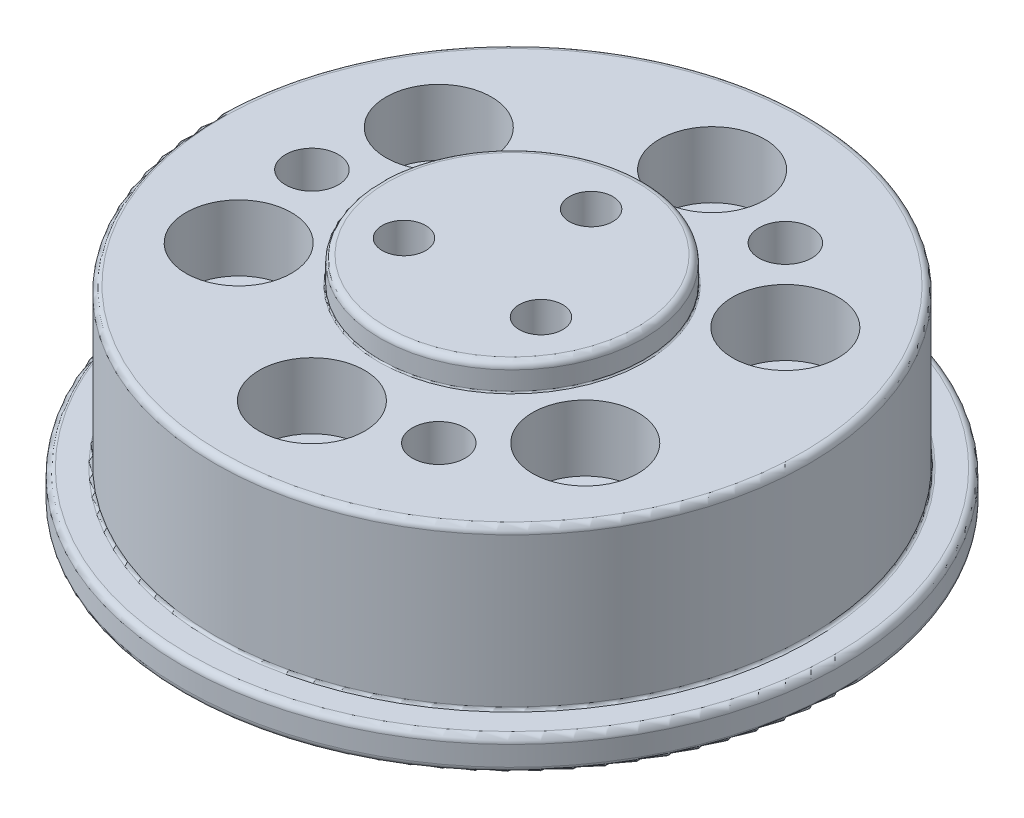
ISO-10303-21;
HEADER;
FILE_DESCRIPTION(('STEP AP214'),'2;1');
FILE_NAME('part.step','',(''),(''),'','','');
FILE_SCHEMA(('AUTOMOTIVE_DESIGN { 1 0 10303 214 1 1 1 1 }'));
ENDSEC;
DATA;
#1=APPLICATION_CONTEXT('core data for automotive mechanical design processes');
#2=APPLICATION_PROTOCOL_DEFINITION('international standard','automotive_design',2000,#1);
#3=PRODUCT_CONTEXT('',#1,'mechanical');
#4=PRODUCT('Part','Part','',(#3));
#5=PRODUCT_RELATED_PRODUCT_CATEGORY('part','',(#4));
#6=PRODUCT_DEFINITION_FORMATION('','',#4);
#7=PRODUCT_DEFINITION_CONTEXT('part definition',#1,'design');
#8=PRODUCT_DEFINITION('design','',#6,#7);
#9=PRODUCT_DEFINITION_SHAPE('','',#8);
#10=(LENGTH_UNIT() NAMED_UNIT(*) SI_UNIT(.MILLI.,.METRE.));
#11=(NAMED_UNIT(*) PLANE_ANGLE_UNIT() SI_UNIT($,.RADIAN.));
#12=(NAMED_UNIT(*) SI_UNIT($,.STERADIAN.) SOLID_ANGLE_UNIT());
#13=UNCERTAINTY_MEASURE_WITH_UNIT(LENGTH_MEASURE(1.E-05),#10,'distance_accuracy_value','');
#14=(GEOMETRIC_REPRESENTATION_CONTEXT(3) GLOBAL_UNCERTAINTY_ASSIGNED_CONTEXT((#13)) GLOBAL_UNIT_ASSIGNED_CONTEXT((#10,
#11,#12)) REPRESENTATION_CONTEXT('',''));
#15=CARTESIAN_POINT('',(0.,0.,0.));
#16=DIRECTION('',(0.,0.,1.));
#17=DIRECTION('',(1.,0.,0.));
#18=AXIS2_PLACEMENT_3D('',#15,#16,#17);
#19=CARTESIAN_POINT('',(0.,2.5,0.));
#20=DIRECTION('',(0.,-1.,0.));
#21=DIRECTION('',(0.,0.,-1.));
#22=AXIS2_PLACEMENT_3D('',#19,#20,#21);
#23=CYLINDRICAL_SURFACE('',#22,10.1);
#24=CARTESIAN_POINT('',(0.,0.5,0.));
#25=DIRECTION('',(0.,1.,0.));
#26=DIRECTION('',(0.,0.,1.));
#27=AXIS2_PLACEMENT_3D('',#24,#25,#26);
#28=CIRCLE('',#27,10.1);
#29=CARTESIAN_POINT('',(0.,0.5,10.1));
#30=VERTEX_POINT('',#29);
#31=EDGE_CURVE('E156',#30,#30,#28,.T.);
#32=ORIENTED_EDGE('',*,*,#31,.T.);
#33=EDGE_LOOP('',(#32));
#34=FACE_BOUND('',#33,.T.);
#35=CARTESIAN_POINT('',(0.,2.,0.));
#36=DIRECTION('',(0.,1.,0.));
#37=DIRECTION('',(0.,0.,1.));
#38=AXIS2_PLACEMENT_3D('',#35,#36,#37);
#39=CIRCLE('',#38,10.1);
#40=CARTESIAN_POINT('',(0.,2.,10.1));
#41=VERTEX_POINT('',#40);
#42=EDGE_CURVE('E143',#41,#41,#39,.F.);
#43=ORIENTED_EDGE('',*,*,#42,.T.);
#44=EDGE_LOOP('',(#43));
#45=FACE_BOUND('',#44,.T.);
#46=ADVANCED_FACE('F34',(#34,#45),#23,.T.);
#47=CARTESIAN_POINT('',(0.,0.,0.));
#48=DIRECTION('',(0.,1.,0.));
#49=DIRECTION('',(0.,0.,1.));
#50=AXIS2_PLACEMENT_3D('',#47,#48,#49);
#51=PLANE('',#50);
#52=CARTESIAN_POINT('',(0.,0.,0.));
#53=DIRECTION('',(0.,1.,0.));
#54=DIRECTION('',(0.,0.,1.));
#55=AXIS2_PLACEMENT_3D('',#52,#53,#54);
#56=CIRCLE('',#55,9.6);
#57=CARTESIAN_POINT('',(0.,0.,9.6));
#58=VERTEX_POINT('',#57);
#59=EDGE_CURVE('E159',#58,#58,#56,.F.);
#60=ORIENTED_EDGE('',*,*,#59,.T.);
#61=EDGE_LOOP('',(#60));
#62=FACE_BOUND('',#61,.T.);
#63=ADVANCED_FACE('F215',(#62),#51,.F.);
#64=CARTESIAN_POINT('',(0.,5.,0.));
#65=DIRECTION('',(0.,-1.,0.));
#66=DIRECTION('',(0.,0.,-1.));
#67=AXIS2_PLACEMENT_3D('',#64,#65,#66);
#68=CYLINDRICAL_SURFACE('',#67,25.);
#69=CARTESIAN_POINT('',(0.,3.,0.));
#70=DIRECTION('',(0.,1.,0.));
#71=DIRECTION('',(0.,0.,1.));
#72=AXIS2_PLACEMENT_3D('',#69,#70,#71);
#73=CIRCLE('',#72,25.);
#74=CARTESIAN_POINT('',(0.,3.,25.));
#75=VERTEX_POINT('',#74);
#76=EDGE_CURVE('E171',#75,#75,#73,.T.);
#77=ORIENTED_EDGE('',*,*,#76,.T.);
#78=EDGE_LOOP('',(#77));
#79=FACE_BOUND('',#78,.T.);
#80=CARTESIAN_POINT('',(0.,4.5,0.));
#81=DIRECTION('',(0.,1.,0.));
#82=DIRECTION('',(0.,0.,1.));
#83=AXIS2_PLACEMENT_3D('',#80,#81,#82);
#84=CIRCLE('',#83,25.);
#85=CARTESIAN_POINT('',(0.,4.5,25.));
#86=VERTEX_POINT('',#85);
#87=EDGE_CURVE('E168',#86,#86,#84,.F.);
#88=ORIENTED_EDGE('',*,*,#87,.T.);
#89=EDGE_LOOP('',(#88));
#90=FACE_BOUND('',#89,.T.);
#91=ADVANCED_FACE('F221',(#79,#90),#68,.T.);
#92=CARTESIAN_POINT('',(0.,5.,0.));
#93=DIRECTION('',(0.,1.,0.));
#94=DIRECTION('',(0.,0.,1.));
#95=AXIS2_PLACEMENT_3D('',#92,#93,#94);
#96=PLANE('',#95);
#97=CARTESIAN_POINT('',(0.,5.,0.));
#98=DIRECTION('',(0.,1.,0.));
#99=DIRECTION('',(0.,0.,1.));
#100=AXIS2_PLACEMENT_3D('',#97,#98,#99);
#101=CIRCLE('',#100,22.7);
#102=CARTESIAN_POINT('',(0.,5.,22.7));
#103=VERTEX_POINT('',#102);
#104=EDGE_CURVE('E186',#103,#103,#101,.F.);
#105=ORIENTED_EDGE('',*,*,#104,.T.);
#106=EDGE_LOOP('',(#105));
#107=FACE_BOUND('',#106,.T.);
#108=CARTESIAN_POINT('',(0.,5.,0.));
#109=DIRECTION('',(0.,1.,0.));
#110=DIRECTION('',(0.,0.,1.));
#111=AXIS2_PLACEMENT_3D('',#108,#109,#110);
#112=CIRCLE('',#111,24.5);
#113=CARTESIAN_POINT('',(0.,5.,24.5));
#114=VERTEX_POINT('',#113);
#115=EDGE_CURVE('E174',#114,#114,#112,.T.);
#116=ORIENTED_EDGE('',*,*,#115,.T.);
#117=EDGE_LOOP('',(#116));
#118=FACE_BOUND('',#117,.T.);
#119=ADVANCED_FACE('F309',(#107,#118),#96,.T.);
#120=CARTESIAN_POINT('',(0.,2.5,0.));
#121=DIRECTION('',(0.,1.,0.));
#122=DIRECTION('',(0.,0.,1.));
#123=AXIS2_PLACEMENT_3D('',#120,#121,#122);
#124=PLANE('',#123);
#125=CARTESIAN_POINT('',(7.58999999999988,2.5,-13.1462656294478));
#126=DIRECTION('',(0.,1.,0.));
#127=DIRECTION('',(0.,0.,1.));
#128=AXIS2_PLACEMENT_3D('',#125,#126,#127);
#129=CIRCLE('',#128,2.);
#130=CARTESIAN_POINT('',(7.58999999999988,2.5,-11.1462656294478));
#131=VERTEX_POINT('',#130);
#132=EDGE_CURVE('E655',#131,#131,#129,.T.);
#133=ORIENTED_EDGE('',*,*,#132,.T.);
#134=EDGE_LOOP('',(#133));
#135=FACE_BOUND('',#134,.T.);
#136=CARTESIAN_POINT('',(7.59000000000006,2.5,13.1462656294477));
#137=DIRECTION('',(0.,1.,0.));
#138=DIRECTION('',(0.,0.,1.));
#139=AXIS2_PLACEMENT_3D('',#136,#137,#138);
#140=CIRCLE('',#139,2.);
#141=CARTESIAN_POINT('',(7.59000000000006,2.5,15.1462656294477));
#142=VERTEX_POINT('',#141);
#143=EDGE_CURVE('E659',#142,#142,#140,.T.);
#144=ORIENTED_EDGE('',*,*,#143,.T.);
#145=EDGE_LOOP('',(#144));
#146=FACE_BOUND('',#145,.T.);
#147=CARTESIAN_POINT('',(-15.18,2.5,0.));
#148=DIRECTION('',(0.,1.,0.));
#149=DIRECTION('',(0.,0.,1.));
#150=AXIS2_PLACEMENT_3D('',#147,#148,#149);
#151=CIRCLE('',#150,2.);
#152=CARTESIAN_POINT('',(-15.18,2.5,2.));
#153=VERTEX_POINT('',#152);
#154=EDGE_CURVE('E69',#153,#153,#151,.T.);
#155=ORIENTED_EDGE('',*,*,#154,.T.);
#156=EDGE_LOOP('',(#155));
#157=FACE_BOUND('',#156,.T.);
#158=CARTESIAN_POINT('',(0.,2.5,0.));
#159=DIRECTION('',(0.,1.,0.));
#160=DIRECTION('',(0.,0.,1.));
#161=AXIS2_PLACEMENT_3D('',#158,#159,#160);
#162=CIRCLE('',#161,10.6);
#163=CARTESIAN_POINT('',(0.,2.5,10.6));
#164=VERTEX_POINT('',#163);
#165=EDGE_CURVE('E165',#164,#164,#162,.T.);
#166=ORIENTED_EDGE('',*,*,#165,.T.);
#167=EDGE_LOOP('',(#166));
#168=FACE_BOUND('',#167,.T.);
#169=CARTESIAN_POINT('',(0.,2.5,0.));
#170=DIRECTION('',(0.,1.,0.));
#171=DIRECTION('',(0.,0.,1.));
#172=AXIS2_PLACEMENT_3D('',#169,#170,#171);
#173=CIRCLE('',#172,24.5);
#174=CARTESIAN_POINT('',(0.,2.5,24.5));
#175=VERTEX_POINT('',#174);
#176=EDGE_CURVE('E162',#175,#175,#173,.F.);
#177=ORIENTED_EDGE('',*,*,#176,.T.);
#178=EDGE_LOOP('',(#177));
#179=FACE_BOUND('',#178,.T.);
#180=CARTESIAN_POINT('',(13.1462656294477,2.5,-7.59000000000015));
#181=DIRECTION('',(0.,1.,0.));
#182=DIRECTION('',(0.,0.,1.));
#183=AXIS2_PLACEMENT_3D('',#180,#181,#182);
#184=CIRCLE('',#183,2.25);
#185=CARTESIAN_POINT('',(13.1462656294477,2.5,-5.34000000000016));
#186=VERTEX_POINT('',#185);
#187=EDGE_CURVE('E90',#186,#186,#184,.T.);
#188=ORIENTED_EDGE('',*,*,#187,.T.);
#189=EDGE_LOOP('',(#188));
#190=FACE_BOUND('',#189,.T.);
#191=CARTESIAN_POINT('',(13.1462656294478,2.5,7.58999999999988));
#192=DIRECTION('',(0.,1.,0.));
#193=DIRECTION('',(0.,0.,1.));
#194=AXIS2_PLACEMENT_3D('',#191,#192,#193);
#195=CIRCLE('',#194,2.25);
#196=CARTESIAN_POINT('',(13.1462656294478,2.5,9.83999999999988));
#197=VERTEX_POINT('',#196);
#198=EDGE_CURVE('E100',#197,#197,#195,.T.);
#199=ORIENTED_EDGE('',*,*,#198,.T.);
#200=EDGE_LOOP('',(#199));
#201=FACE_BOUND('',#200,.T.);
#202=CARTESIAN_POINT('',(0.,2.5,15.18));
#203=DIRECTION('',(0.,1.,0.));
#204=DIRECTION('',(0.,0.,1.));
#205=AXIS2_PLACEMENT_3D('',#202,#203,#204);
#206=CIRCLE('',#205,2.25);
#207=CARTESIAN_POINT('',(0.,2.5,17.43));
#208=VERTEX_POINT('',#207);
#209=EDGE_CURVE('E110',#208,#208,#206,.T.);
#210=ORIENTED_EDGE('',*,*,#209,.T.);
#211=EDGE_LOOP('',(#210));
#212=FACE_BOUND('',#211,.T.);
#213=CARTESIAN_POINT('',(-13.1462656294477,2.5,7.59000000000006));
#214=DIRECTION('',(0.,1.,0.));
#215=DIRECTION('',(0.,0.,1.));
#216=AXIS2_PLACEMENT_3D('',#213,#214,#215);
#217=CIRCLE('',#216,2.25);
#218=CARTESIAN_POINT('',(-13.1462656294477,2.5,9.84000000000006));
#219=VERTEX_POINT('',#218);
#220=EDGE_CURVE('E120',#219,#219,#217,.T.);
#221=ORIENTED_EDGE('',*,*,#220,.T.);
#222=EDGE_LOOP('',(#221));
#223=FACE_BOUND('',#222,.T.);
#224=CARTESIAN_POINT('',(-13.1462656294478,2.5,-7.58999999999997));
#225=DIRECTION('',(0.,1.,0.));
#226=DIRECTION('',(0.,0.,1.));
#227=AXIS2_PLACEMENT_3D('',#224,#225,#226);
#228=CIRCLE('',#227,2.25);
#229=CARTESIAN_POINT('',(-13.1462656294478,2.5,-5.33999999999997));
#230=VERTEX_POINT('',#229);
#231=EDGE_CURVE('E130',#230,#230,#228,.T.);
#232=ORIENTED_EDGE('',*,*,#231,.T.);
#233=EDGE_LOOP('',(#232));
#234=FACE_BOUND('',#233,.T.);
#235=CARTESIAN_POINT('',(0.,2.5,-15.18));
#236=DIRECTION('',(0.,1.,0.));
#237=DIRECTION('',(0.,0.,1.));
#238=AXIS2_PLACEMENT_3D('',#235,#236,#237);
#239=CIRCLE('',#238,2.25);
#240=CARTESIAN_POINT('',(0.,2.5,-12.93));
#241=VERTEX_POINT('',#240);
#242=EDGE_CURVE('E140',#241,#241,#239,.T.);
#243=ORIENTED_EDGE('',*,*,#242,.T.);
#244=EDGE_LOOP('',(#243));
#245=FACE_BOUND('',#244,.T.);
#246=ADVANCED_FACE('F259',(#135,#146,#157,#168,#179,#190,#201,#212,#223,#234,#245),#124,.F.);
#247=CARTESIAN_POINT('',(0.,17.,0.));
#248=DIRECTION('',(0.,-1.,0.));
#249=DIRECTION('',(0.,0.,-1.));
#250=AXIS2_PLACEMENT_3D('',#247,#248,#249);
#251=CYLINDRICAL_SURFACE('',#250,22.5);
#252=CARTESIAN_POINT('',(0.,5.2,0.));
#253=DIRECTION('',(0.,1.,0.));
#254=DIRECTION('',(0.,0.,1.));
#255=AXIS2_PLACEMENT_3D('',#252,#253,#254);
#256=CIRCLE('',#255,22.5);
#257=CARTESIAN_POINT('',(0.,5.2,22.5));
#258=VERTEX_POINT('',#257);
#259=EDGE_CURVE('E183',#258,#258,#256,.T.);
#260=ORIENTED_EDGE('',*,*,#259,.T.);
#261=EDGE_LOOP('',(#260));
#262=FACE_BOUND('',#261,.T.);
#263=CARTESIAN_POINT('',(0.,16.5,0.));
#264=DIRECTION('',(0.,1.,0.));
#265=DIRECTION('',(0.,0.,1.));
#266=AXIS2_PLACEMENT_3D('',#263,#264,#265);
#267=CIRCLE('',#266,22.5);
#268=CARTESIAN_POINT('',(0.,16.5,22.5));
#269=VERTEX_POINT('',#268);
#270=EDGE_CURVE('E180',#269,#269,#267,.F.);
#271=ORIENTED_EDGE('',*,*,#270,.T.);
#272=EDGE_LOOP('',(#271));
#273=FACE_BOUND('',#272,.T.);
#274=ADVANCED_FACE('F255',(#262,#273),#251,.T.);
#275=CARTESIAN_POINT('',(0.,17.,0.));
#276=DIRECTION('',(0.,1.,0.));
#277=DIRECTION('',(0.,0.,1.));
#278=AXIS2_PLACEMENT_3D('',#275,#276,#277);
#279=PLANE('',#278);
#280=CARTESIAN_POINT('',(7.58999999999988,17.,-13.1462656294478));
#281=DIRECTION('',(0.,1.,0.));
#282=DIRECTION('',(0.,0.,1.));
#283=AXIS2_PLACEMENT_3D('',#280,#281,#282);
#284=CIRCLE('',#283,2.);
#285=CARTESIAN_POINT('',(7.58999999999988,17.,-11.1462656294478));
#286=VERTEX_POINT('',#285);
#287=EDGE_CURVE('E652',#286,#286,#284,.T.);
#288=ORIENTED_EDGE('',*,*,#287,.F.);
#289=EDGE_LOOP('',(#288));
#290=FACE_BOUND('',#289,.T.);
#291=CARTESIAN_POINT('',(7.59000000000006,17.,13.1462656294477));
#292=DIRECTION('',(0.,1.,0.));
#293=DIRECTION('',(0.,0.,1.));
#294=AXIS2_PLACEMENT_3D('',#291,#292,#293);
#295=CIRCLE('',#294,2.);
#296=CARTESIAN_POINT('',(7.59000000000006,17.,15.1462656294477));
#297=VERTEX_POINT('',#296);
#298=EDGE_CURVE('E656',#297,#297,#295,.T.);
#299=ORIENTED_EDGE('',*,*,#298,.F.);
#300=EDGE_LOOP('',(#299));
#301=FACE_BOUND('',#300,.T.);
#302=CARTESIAN_POINT('',(-15.18,17.,0.));
#303=DIRECTION('',(0.,1.,0.));
#304=DIRECTION('',(0.,0.,1.));
#305=AXIS2_PLACEMENT_3D('',#302,#303,#304);
#306=CIRCLE('',#305,2.);
#307=CARTESIAN_POINT('',(-15.18,17.,2.));
#308=VERTEX_POINT('',#307);
#309=EDGE_CURVE('E665',#308,#308,#306,.T.);
#310=ORIENTED_EDGE('',*,*,#309,.F.);
#311=EDGE_LOOP('',(#310));
#312=FACE_BOUND('',#311,.T.);
#313=CARTESIAN_POINT('',(0.,17.,0.));
#314=DIRECTION('',(0.,1.,0.));
#315=DIRECTION('',(0.,0.,1.));
#316=AXIS2_PLACEMENT_3D('',#313,#314,#315);
#317=CIRCLE('',#316,10.1);
#318=CARTESIAN_POINT('',(0.,17.,10.1));
#319=VERTEX_POINT('',#318);
#320=EDGE_CURVE('E192',#319,#319,#317,.F.);
#321=ORIENTED_EDGE('',*,*,#320,.T.);
#322=EDGE_LOOP('',(#321));
#323=FACE_BOUND('',#322,.T.);
#324=CARTESIAN_POINT('',(0.,17.,0.));
#325=DIRECTION('',(0.,1.,0.));
#326=DIRECTION('',(0.,0.,1.));
#327=AXIS2_PLACEMENT_3D('',#324,#325,#326);
#328=CIRCLE('',#327,22.);
#329=CARTESIAN_POINT('',(0.,17.,22.));
#330=VERTEX_POINT('',#329);
#331=EDGE_CURVE('E177',#330,#330,#328,.T.);
#332=ORIENTED_EDGE('',*,*,#331,.T.);
#333=EDGE_LOOP('',(#332));
#334=FACE_BOUND('',#333,.T.);
#335=CARTESIAN_POINT('',(13.1462656294477,17.,-7.59000000000015));
#336=DIRECTION('',(0.,1.,0.));
#337=DIRECTION('',(0.,0.,1.));
#338=AXIS2_PLACEMENT_3D('',#335,#336,#337);
#339=CIRCLE('',#338,4.);
#340=CARTESIAN_POINT('',(13.1462656294477,17.,-3.59000000000016));
#341=VERTEX_POINT('',#340);
#342=EDGE_CURVE('E81',#341,#341,#339,.T.);
#343=ORIENTED_EDGE('',*,*,#342,.F.);
#344=EDGE_LOOP('',(#343));
#345=FACE_BOUND('',#344,.T.);
#346=CARTESIAN_POINT('',(13.1462656294478,17.,7.58999999999988));
#347=DIRECTION('',(0.,1.,0.));
#348=DIRECTION('',(0.,0.,1.));
#349=AXIS2_PLACEMENT_3D('',#346,#347,#348);
#350=CIRCLE('',#349,4.);
#351=CARTESIAN_POINT('',(13.1462656294478,17.,11.5899999999999));
#352=VERTEX_POINT('',#351);
#353=EDGE_CURVE('E91',#352,#352,#350,.T.);
#354=ORIENTED_EDGE('',*,*,#353,.F.);
#355=EDGE_LOOP('',(#354));
#356=FACE_BOUND('',#355,.T.);
#357=CARTESIAN_POINT('',(0.,17.,15.18));
#358=DIRECTION('',(0.,1.,0.));
#359=DIRECTION('',(0.,0.,1.));
#360=AXIS2_PLACEMENT_3D('',#357,#358,#359);
#361=CIRCLE('',#360,4.);
#362=CARTESIAN_POINT('',(0.,17.,19.18));
#363=VERTEX_POINT('',#362);
#364=EDGE_CURVE('E101',#363,#363,#361,.T.);
#365=ORIENTED_EDGE('',*,*,#364,.F.);
#366=EDGE_LOOP('',(#365));
#367=FACE_BOUND('',#366,.T.);
#368=CARTESIAN_POINT('',(-13.1462656294477,17.,7.59000000000006));
#369=DIRECTION('',(0.,1.,0.));
#370=DIRECTION('',(0.,0.,1.));
#371=AXIS2_PLACEMENT_3D('',#368,#369,#370);
#372=CIRCLE('',#371,4.);
#373=CARTESIAN_POINT('',(-13.1462656294477,17.,11.5900000000001));
#374=VERTEX_POINT('',#373);
#375=EDGE_CURVE('E111',#374,#374,#372,.T.);
#376=ORIENTED_EDGE('',*,*,#375,.F.);
#377=EDGE_LOOP('',(#376));
#378=FACE_BOUND('',#377,.T.);
#379=CARTESIAN_POINT('',(-13.1462656294478,17.,-7.58999999999997));
#380=DIRECTION('',(0.,1.,0.));
#381=DIRECTION('',(0.,0.,1.));
#382=AXIS2_PLACEMENT_3D('',#379,#380,#381);
#383=CIRCLE('',#382,4.);
#384=CARTESIAN_POINT('',(-13.1462656294478,17.,-3.58999999999997));
#385=VERTEX_POINT('',#384);
#386=EDGE_CURVE('E121',#385,#385,#383,.T.);
#387=ORIENTED_EDGE('',*,*,#386,.F.);
#388=EDGE_LOOP('',(#387));
#389=FACE_BOUND('',#388,.T.);
#390=CARTESIAN_POINT('',(0.,17.,-15.18));
#391=DIRECTION('',(0.,1.,0.));
#392=DIRECTION('',(0.,0.,1.));
#393=AXIS2_PLACEMENT_3D('',#390,#391,#392);
#394=CIRCLE('',#393,4.);
#395=CARTESIAN_POINT('',(0.,17.,-11.18));
#396=VERTEX_POINT('',#395);
#397=EDGE_CURVE('E131',#396,#396,#394,.T.);
#398=ORIENTED_EDGE('',*,*,#397,.F.);
#399=EDGE_LOOP('',(#398));
#400=FACE_BOUND('',#399,.T.);
#401=ADVANCED_FACE('F258',(#290,#301,#312,#323,#334,#345,#356,#367,#378,#389,#400),#279,.T.);
#402=CARTESIAN_POINT('',(0.,19.,0.));
#403=DIRECTION('',(0.,-1.,0.));
#404=DIRECTION('',(0.,0.,-1.));
#405=AXIS2_PLACEMENT_3D('',#402,#403,#404);
#406=CYLINDRICAL_SURFACE('',#405,10.);
#407=CARTESIAN_POINT('',(0.,18.5,0.));
#408=DIRECTION('',(0.,1.,0.));
#409=DIRECTION('',(0.,0.,1.));
#410=AXIS2_PLACEMENT_3D('',#407,#408,#409);
#411=CIRCLE('',#410,10.);
#412=CARTESIAN_POINT('',(0.,18.5,10.));
#413=VERTEX_POINT('',#412);
#414=EDGE_CURVE('E11',#413,#413,#411,.F.);
#415=ORIENTED_EDGE('',*,*,#414,.T.);
#416=EDGE_LOOP('',(#415));
#417=FACE_BOUND('',#416,.T.);
#418=CARTESIAN_POINT('',(0.,17.1,0.));
#419=DIRECTION('',(0.,1.,0.));
#420=DIRECTION('',(0.,0.,1.));
#421=AXIS2_PLACEMENT_3D('',#418,#419,#420);
#422=CIRCLE('',#421,10.);
#423=CARTESIAN_POINT('',(0.,17.1,10.));
#424=VERTEX_POINT('',#423);
#425=EDGE_CURVE('E189',#424,#424,#422,.T.);
#426=ORIENTED_EDGE('',*,*,#425,.T.);
#427=EDGE_LOOP('',(#426));
#428=FACE_BOUND('',#427,.T.);
#429=ADVANCED_FACE('F267',(#417,#428),#406,.T.);
#430=CARTESIAN_POINT('',(0.,19.,0.));
#431=DIRECTION('',(0.,1.,0.));
#432=DIRECTION('',(0.,0.,1.));
#433=AXIS2_PLACEMENT_3D('',#430,#431,#432);
#434=PLANE('',#433);
#435=CARTESIAN_POINT('',(0.,19.,0.));
#436=DIRECTION('',(0.,1.,0.));
#437=DIRECTION('',(0.,0.,1.));
#438=AXIS2_PLACEMENT_3D('',#435,#436,#437);
#439=CIRCLE('',#438,9.5);
#440=CARTESIAN_POINT('',(0.,19.,9.5));
#441=VERTEX_POINT('',#440);
#442=EDGE_CURVE('E42',#441,#441,#439,.T.);
#443=ORIENTED_EDGE('',*,*,#442,.T.);
#444=EDGE_LOOP('',(#443));
#445=FACE_BOUND('',#444,.T.);
#446=CARTESIAN_POINT('',(5.19615242270666,19.,2.99999999999995));
#447=DIRECTION('',(0.,1.,0.));
#448=DIRECTION('',(0.,0.,1.));
#449=AXIS2_PLACEMENT_3D('',#446,#447,#448);
#450=CIRCLE('',#449,1.64999999999999);
#451=CARTESIAN_POINT('',(5.19615242270666,19.,4.64999999999994));
#452=VERTEX_POINT('',#451);
#453=EDGE_CURVE('E63',#452,#452,#450,.T.);
#454=ORIENTED_EDGE('',*,*,#453,.F.);
#455=EDGE_LOOP('',(#454));
#456=FACE_BOUND('',#455,.T.);
#457=CARTESIAN_POINT('',(-5.19615242270662,19.,3.00000000000002));
#458=DIRECTION('',(0.,1.,0.));
#459=DIRECTION('',(0.,0.,1.));
#460=AXIS2_PLACEMENT_3D('',#457,#458,#459);
#461=CIRCLE('',#460,1.64999999999999);
#462=CARTESIAN_POINT('',(-5.19615242270662,19.,4.65000000000002));
#463=VERTEX_POINT('',#462);
#464=EDGE_CURVE('E62',#463,#463,#461,.T.);
#465=ORIENTED_EDGE('',*,*,#464,.F.);
#466=EDGE_LOOP('',(#465));
#467=FACE_BOUND('',#466,.T.);
#468=CARTESIAN_POINT('',(0.,19.,-6.));
#469=DIRECTION('',(0.,1.,0.));
#470=DIRECTION('',(0.,0.,1.));
#471=AXIS2_PLACEMENT_3D('',#468,#469,#470);
#472=CIRCLE('',#471,1.64999999999999);
#473=CARTESIAN_POINT('',(0.,19.,-4.35000000000001));
#474=VERTEX_POINT('',#473);
#475=EDGE_CURVE('E75',#474,#474,#472,.T.);
#476=ORIENTED_EDGE('',*,*,#475,.F.);
#477=EDGE_LOOP('',(#476));
#478=FACE_BOUND('',#477,.T.);
#479=ADVANCED_FACE('F197',(#445,#456,#467,#478),#434,.T.);
#480=CARTESIAN_POINT('',(0.,17.,-15.18));
#481=DIRECTION('',(0.,1.,0.));
#482=DIRECTION('',(0.,0.,1.));
#483=AXIS2_PLACEMENT_3D('',#480,#481,#482);
#484=CYLINDRICAL_SURFACE('',#483,2.25);
#485=CARTESIAN_POINT('',(0.,12.,-15.18));
#486=DIRECTION('',(0.,1.,0.));
#487=DIRECTION('',(0.,0.,1.));
#488=AXIS2_PLACEMENT_3D('',#485,#486,#487);
#489=CIRCLE('',#488,2.25);
#490=CARTESIAN_POINT('',(0.,12.,-12.93));
#491=VERTEX_POINT('',#490);
#492=EDGE_CURVE('E137',#491,#491,#489,.T.);
#493=ORIENTED_EDGE('',*,*,#492,.T.);
#494=EDGE_LOOP('',(#493));
#495=FACE_BOUND('',#494,.T.);
#496=ORIENTED_EDGE('',*,*,#242,.F.);
#497=EDGE_LOOP('',(#496));
#498=FACE_BOUND('',#497,.T.);
#499=ADVANCED_FACE('F295',(#495,#498),#484,.F.);
#500=CARTESIAN_POINT('',(2.25,12.,-15.18));
#501=DIRECTION('',(0.,-1.,0.));
#502=DIRECTION('',(0.,0.,-1.));
#503=AXIS2_PLACEMENT_3D('',#500,#501,#502);
#504=PLANE('',#503);
#505=ORIENTED_EDGE('',*,*,#492,.F.);
#506=EDGE_LOOP('',(#505));
#507=FACE_BOUND('',#506,.T.);
#508=CARTESIAN_POINT('',(0.,12.,-15.18));
#509=DIRECTION('',(0.,1.,0.));
#510=DIRECTION('',(0.,0.,1.));
#511=AXIS2_PLACEMENT_3D('',#508,#509,#510);
#512=CIRCLE('',#511,4.);
#513=CARTESIAN_POINT('',(0.,12.,-11.18));
#514=VERTEX_POINT('',#513);
#515=EDGE_CURVE('E134',#514,#514,#512,.T.);
#516=ORIENTED_EDGE('',*,*,#515,.T.);
#517=EDGE_LOOP('',(#516));
#518=FACE_BOUND('',#517,.T.);
#519=ADVANCED_FACE('F285',(#507,#518),#504,.F.);
#520=CARTESIAN_POINT('',(0.,17.,-15.18));
#521=DIRECTION('',(0.,1.,0.));
#522=DIRECTION('',(0.,0.,1.));
#523=AXIS2_PLACEMENT_3D('',#520,#521,#522);
#524=CYLINDRICAL_SURFACE('',#523,4.);
#525=ORIENTED_EDGE('',*,*,#515,.F.);
#526=EDGE_LOOP('',(#525));
#527=FACE_BOUND('',#526,.T.);
#528=ORIENTED_EDGE('',*,*,#397,.T.);
#529=EDGE_LOOP('',(#528));
#530=FACE_BOUND('',#529,.T.);
#531=ADVANCED_FACE('F282',(#527,#530),#524,.F.);
#532=CARTESIAN_POINT('',(-13.1462656294478,17.,-7.58999999999997));
#533=DIRECTION('',(0.,1.,0.));
#534=DIRECTION('',(0.,0.,1.));
#535=AXIS2_PLACEMENT_3D('',#532,#533,#534);
#536=CYLINDRICAL_SURFACE('',#535,2.25);
#537=CARTESIAN_POINT('',(-13.1462656294478,12.,-7.58999999999997));
#538=DIRECTION('',(0.,1.,0.));
#539=DIRECTION('',(0.,0.,1.));
#540=AXIS2_PLACEMENT_3D('',#537,#538,#539);
#541=CIRCLE('',#540,2.25);
#542=CARTESIAN_POINT('',(-13.1462656294478,12.,-5.33999999999997));
#543=VERTEX_POINT('',#542);
#544=EDGE_CURVE('E127',#543,#543,#541,.T.);
#545=ORIENTED_EDGE('',*,*,#544,.T.);
#546=EDGE_LOOP('',(#545));
#547=FACE_BOUND('',#546,.T.);
#548=ORIENTED_EDGE('',*,*,#231,.F.);
#549=EDGE_LOOP('',(#548));
#550=FACE_BOUND('',#549,.T.);
#551=ADVANCED_FACE('F284',(#547,#550),#536,.F.);
#552=CARTESIAN_POINT('',(-10.8962656294478,12.,-7.58999999999997));
#553=DIRECTION('',(0.,-1.,0.));
#554=DIRECTION('',(0.,0.,-1.));
#555=AXIS2_PLACEMENT_3D('',#552,#553,#554);
#556=PLANE('',#555);
#557=ORIENTED_EDGE('',*,*,#544,.F.);
#558=EDGE_LOOP('',(#557));
#559=FACE_BOUND('',#558,.T.);
#560=CARTESIAN_POINT('',(-13.1462656294478,12.,-7.58999999999997));
#561=DIRECTION('',(0.,1.,0.));
#562=DIRECTION('',(0.,0.,1.));
#563=AXIS2_PLACEMENT_3D('',#560,#561,#562);
#564=CIRCLE('',#563,4.);
#565=CARTESIAN_POINT('',(-13.1462656294478,12.,-3.58999999999997));
#566=VERTEX_POINT('',#565);
#567=EDGE_CURVE('E124',#566,#566,#564,.T.);
#568=ORIENTED_EDGE('',*,*,#567,.T.);
#569=EDGE_LOOP('',(#568));
#570=FACE_BOUND('',#569,.T.);
#571=ADVANCED_FACE('F292',(#559,#570),#556,.F.);
#572=CARTESIAN_POINT('',(-13.1462656294478,17.,-7.58999999999997));
#573=DIRECTION('',(0.,1.,0.));
#574=DIRECTION('',(0.,0.,1.));
#575=AXIS2_PLACEMENT_3D('',#572,#573,#574);
#576=CYLINDRICAL_SURFACE('',#575,4.);
#577=ORIENTED_EDGE('',*,*,#567,.F.);
#578=EDGE_LOOP('',(#577));
#579=FACE_BOUND('',#578,.T.);
#580=ORIENTED_EDGE('',*,*,#386,.T.);
#581=EDGE_LOOP('',(#580));
#582=FACE_BOUND('',#581,.T.);
#583=ADVANCED_FACE('F384',(#579,#582),#576,.F.);
#584=CARTESIAN_POINT('',(-13.1462656294477,17.,7.59000000000006));
#585=DIRECTION('',(0.,1.,0.));
#586=DIRECTION('',(0.,0.,1.));
#587=AXIS2_PLACEMENT_3D('',#584,#585,#586);
#588=CYLINDRICAL_SURFACE('',#587,2.25);
#589=CARTESIAN_POINT('',(-13.1462656294477,12.,7.59000000000006));
#590=DIRECTION('',(0.,1.,0.));
#591=DIRECTION('',(0.,0.,1.));
#592=AXIS2_PLACEMENT_3D('',#589,#590,#591);
#593=CIRCLE('',#592,2.25);
#594=CARTESIAN_POINT('',(-13.1462656294477,12.,9.84000000000006));
#595=VERTEX_POINT('',#594);
#596=EDGE_CURVE('E117',#595,#595,#593,.T.);
#597=ORIENTED_EDGE('',*,*,#596,.T.);
#598=EDGE_LOOP('',(#597));
#599=FACE_BOUND('',#598,.T.);
#600=ORIENTED_EDGE('',*,*,#220,.F.);
#601=EDGE_LOOP('',(#600));
#602=FACE_BOUND('',#601,.T.);
#603=ADVANCED_FACE('F393',(#599,#602),#588,.F.);
#604=CARTESIAN_POINT('',(-10.8962656294477,12.,7.59000000000006));
#605=DIRECTION('',(0.,-1.,0.));
#606=DIRECTION('',(0.,0.,-1.));
#607=AXIS2_PLACEMENT_3D('',#604,#605,#606);
#608=PLANE('',#607);
#609=ORIENTED_EDGE('',*,*,#596,.F.);
#610=EDGE_LOOP('',(#609));
#611=FACE_BOUND('',#610,.T.);
#612=CARTESIAN_POINT('',(-13.1462656294477,12.,7.59000000000006));
#613=DIRECTION('',(0.,1.,0.));
#614=DIRECTION('',(0.,0.,1.));
#615=AXIS2_PLACEMENT_3D('',#612,#613,#614);
#616=CIRCLE('',#615,4.);
#617=CARTESIAN_POINT('',(-13.1462656294477,12.,11.5900000000001));
#618=VERTEX_POINT('',#617);
#619=EDGE_CURVE('E114',#618,#618,#616,.T.);
#620=ORIENTED_EDGE('',*,*,#619,.T.);
#621=EDGE_LOOP('',(#620));
#622=FACE_BOUND('',#621,.T.);
#623=ADVANCED_FACE('F403',(#611,#622),#608,.F.);
#624=CARTESIAN_POINT('',(-13.1462656294477,17.,7.59000000000006));
#625=DIRECTION('',(0.,1.,0.));
#626=DIRECTION('',(0.,0.,1.));
#627=AXIS2_PLACEMENT_3D('',#624,#625,#626);
#628=CYLINDRICAL_SURFACE('',#627,4.);
#629=ORIENTED_EDGE('',*,*,#619,.F.);
#630=EDGE_LOOP('',(#629));
#631=FACE_BOUND('',#630,.T.);
#632=ORIENTED_EDGE('',*,*,#375,.T.);
#633=EDGE_LOOP('',(#632));
#634=FACE_BOUND('',#633,.T.);
#635=ADVANCED_FACE('F413',(#631,#634),#628,.F.);
#636=CARTESIAN_POINT('',(0.,17.,15.18));
#637=DIRECTION('',(0.,1.,0.));
#638=DIRECTION('',(0.,0.,1.));
#639=AXIS2_PLACEMENT_3D('',#636,#637,#638);
#640=CYLINDRICAL_SURFACE('',#639,2.25);
#641=CARTESIAN_POINT('',(0.,12.,15.18));
#642=DIRECTION('',(0.,1.,0.));
#643=DIRECTION('',(0.,0.,1.));
#644=AXIS2_PLACEMENT_3D('',#641,#642,#643);
#645=CIRCLE('',#644,2.25);
#646=CARTESIAN_POINT('',(0.,12.,17.43));
#647=VERTEX_POINT('',#646);
#648=EDGE_CURVE('E107',#647,#647,#645,.T.);
#649=ORIENTED_EDGE('',*,*,#648,.T.);
#650=EDGE_LOOP('',(#649));
#651=FACE_BOUND('',#650,.T.);
#652=ORIENTED_EDGE('',*,*,#209,.F.);
#653=EDGE_LOOP('',(#652));
#654=FACE_BOUND('',#653,.T.);
#655=ADVANCED_FACE('F423',(#651,#654),#640,.F.);
#656=CARTESIAN_POINT('',(2.25,12.,15.18));
#657=DIRECTION('',(0.,-1.,0.));
#658=DIRECTION('',(0.,0.,-1.));
#659=AXIS2_PLACEMENT_3D('',#656,#657,#658);
#660=PLANE('',#659);
#661=ORIENTED_EDGE('',*,*,#648,.F.);
#662=EDGE_LOOP('',(#661));
#663=FACE_BOUND('',#662,.T.);
#664=CARTESIAN_POINT('',(0.,12.,15.18));
#665=DIRECTION('',(0.,1.,0.));
#666=DIRECTION('',(0.,0.,1.));
#667=AXIS2_PLACEMENT_3D('',#664,#665,#666);
#668=CIRCLE('',#667,4.);
#669=CARTESIAN_POINT('',(0.,12.,19.18));
#670=VERTEX_POINT('',#669);
#671=EDGE_CURVE('E104',#670,#670,#668,.T.);
#672=ORIENTED_EDGE('',*,*,#671,.T.);
#673=EDGE_LOOP('',(#672));
#674=FACE_BOUND('',#673,.T.);
#675=ADVANCED_FACE('F433',(#663,#674),#660,.F.);
#676=CARTESIAN_POINT('',(0.,17.,15.18));
#677=DIRECTION('',(0.,1.,0.));
#678=DIRECTION('',(0.,0.,1.));
#679=AXIS2_PLACEMENT_3D('',#676,#677,#678);
#680=CYLINDRICAL_SURFACE('',#679,4.);
#681=ORIENTED_EDGE('',*,*,#671,.F.);
#682=EDGE_LOOP('',(#681));
#683=FACE_BOUND('',#682,.T.);
#684=ORIENTED_EDGE('',*,*,#364,.T.);
#685=EDGE_LOOP('',(#684));
#686=FACE_BOUND('',#685,.T.);
#687=ADVANCED_FACE('F443',(#683,#686),#680,.F.);
#688=CARTESIAN_POINT('',(13.1462656294478,17.,7.58999999999988));
#689=DIRECTION('',(0.,1.,0.));
#690=DIRECTION('',(0.,0.,1.));
#691=AXIS2_PLACEMENT_3D('',#688,#689,#690);
#692=CYLINDRICAL_SURFACE('',#691,2.25);
#693=CARTESIAN_POINT('',(13.1462656294478,12.,7.58999999999988));
#694=DIRECTION('',(0.,1.,0.));
#695=DIRECTION('',(0.,0.,1.));
#696=AXIS2_PLACEMENT_3D('',#693,#694,#695);
#697=CIRCLE('',#696,2.25);
#698=CARTESIAN_POINT('',(13.1462656294478,12.,9.83999999999988));
#699=VERTEX_POINT('',#698);
#700=EDGE_CURVE('E97',#699,#699,#697,.T.);
#701=ORIENTED_EDGE('',*,*,#700,.T.);
#702=EDGE_LOOP('',(#701));
#703=FACE_BOUND('',#702,.T.);
#704=ORIENTED_EDGE('',*,*,#198,.F.);
#705=EDGE_LOOP('',(#704));
#706=FACE_BOUND('',#705,.T.);
#707=ADVANCED_FACE('F453',(#703,#706),#692,.F.);
#708=CARTESIAN_POINT('',(15.3962656294478,12.,7.58999999999988));
#709=DIRECTION('',(0.,-1.,0.));
#710=DIRECTION('',(0.,0.,-1.));
#711=AXIS2_PLACEMENT_3D('',#708,#709,#710);
#712=PLANE('',#711);
#713=ORIENTED_EDGE('',*,*,#700,.F.);
#714=EDGE_LOOP('',(#713));
#715=FACE_BOUND('',#714,.T.);
#716=CARTESIAN_POINT('',(13.1462656294478,12.,7.58999999999988));
#717=DIRECTION('',(0.,1.,0.));
#718=DIRECTION('',(0.,0.,1.));
#719=AXIS2_PLACEMENT_3D('',#716,#717,#718);
#720=CIRCLE('',#719,4.);
#721=CARTESIAN_POINT('',(13.1462656294478,12.,11.5899999999999));
#722=VERTEX_POINT('',#721);
#723=EDGE_CURVE('E94',#722,#722,#720,.T.);
#724=ORIENTED_EDGE('',*,*,#723,.T.);
#725=EDGE_LOOP('',(#724));
#726=FACE_BOUND('',#725,.T.);
#727=ADVANCED_FACE('F463',(#715,#726),#712,.F.);
#728=CARTESIAN_POINT('',(13.1462656294478,17.,7.58999999999988));
#729=DIRECTION('',(0.,1.,0.));
#730=DIRECTION('',(0.,0.,1.));
#731=AXIS2_PLACEMENT_3D('',#728,#729,#730);
#732=CYLINDRICAL_SURFACE('',#731,4.);
#733=ORIENTED_EDGE('',*,*,#723,.F.);
#734=EDGE_LOOP('',(#733));
#735=FACE_BOUND('',#734,.T.);
#736=ORIENTED_EDGE('',*,*,#353,.T.);
#737=EDGE_LOOP('',(#736));
#738=FACE_BOUND('',#737,.T.);
#739=ADVANCED_FACE('F473',(#735,#738),#732,.F.);
#740=CARTESIAN_POINT('',(13.1462656294477,17.,-7.59000000000015));
#741=DIRECTION('',(0.,1.,0.));
#742=DIRECTION('',(0.,0.,1.));
#743=AXIS2_PLACEMENT_3D('',#740,#741,#742);
#744=CYLINDRICAL_SURFACE('',#743,2.25);
#745=CARTESIAN_POINT('',(13.1462656294477,12.,-7.59000000000015));
#746=DIRECTION('',(0.,1.,0.));
#747=DIRECTION('',(0.,0.,1.));
#748=AXIS2_PLACEMENT_3D('',#745,#746,#747);
#749=CIRCLE('',#748,2.25);
#750=CARTESIAN_POINT('',(13.1462656294477,12.,-5.34000000000015));
#751=VERTEX_POINT('',#750);
#752=EDGE_CURVE('E87',#751,#751,#749,.T.);
#753=ORIENTED_EDGE('',*,*,#752,.T.);
#754=EDGE_LOOP('',(#753));
#755=FACE_BOUND('',#754,.T.);
#756=ORIENTED_EDGE('',*,*,#187,.F.);
#757=EDGE_LOOP('',(#756));
#758=FACE_BOUND('',#757,.T.);
#759=ADVANCED_FACE('F483',(#755,#758),#744,.F.);
#760=CARTESIAN_POINT('',(15.3962656294477,12.,-7.59000000000015));
#761=DIRECTION('',(0.,-1.,0.));
#762=DIRECTION('',(0.,0.,-1.));
#763=AXIS2_PLACEMENT_3D('',#760,#761,#762);
#764=PLANE('',#763);
#765=ORIENTED_EDGE('',*,*,#752,.F.);
#766=EDGE_LOOP('',(#765));
#767=FACE_BOUND('',#766,.T.);
#768=CARTESIAN_POINT('',(13.1462656294477,12.,-7.59000000000015));
#769=DIRECTION('',(0.,1.,0.));
#770=DIRECTION('',(0.,0.,1.));
#771=AXIS2_PLACEMENT_3D('',#768,#769,#770);
#772=CIRCLE('',#771,4.);
#773=CARTESIAN_POINT('',(13.1462656294477,12.,-3.59000000000016));
#774=VERTEX_POINT('',#773);
#775=EDGE_CURVE('E84',#774,#774,#772,.T.);
#776=ORIENTED_EDGE('',*,*,#775,.T.);
#777=EDGE_LOOP('',(#776));
#778=FACE_BOUND('',#777,.T.);
#779=ADVANCED_FACE('F493',(#767,#778),#764,.F.);
#780=CARTESIAN_POINT('',(13.1462656294477,17.,-7.59000000000015));
#781=DIRECTION('',(0.,1.,0.));
#782=DIRECTION('',(0.,0.,1.));
#783=AXIS2_PLACEMENT_3D('',#780,#781,#782);
#784=CYLINDRICAL_SURFACE('',#783,4.);
#785=ORIENTED_EDGE('',*,*,#775,.F.);
#786=EDGE_LOOP('',(#785));
#787=FACE_BOUND('',#786,.T.);
#788=ORIENTED_EDGE('',*,*,#342,.T.);
#789=EDGE_LOOP('',(#788));
#790=FACE_BOUND('',#789,.T.);
#791=ADVANCED_FACE('F503',(#787,#790),#784,.F.);
#792=CARTESIAN_POINT('',(0.,14.,-6.));
#793=DIRECTION('',(0.,1.,0.));
#794=DIRECTION('',(0.,0.,1.));
#795=AXIS2_PLACEMENT_3D('',#792,#793,#794);
#796=CONICAL_SURFACE('',#795,1.65,1.02974425867665);
#797=CARTESIAN_POINT('',(0.,13.0085799786045,-6.));
#798=VERTEX_POINT('',#797);
#799=VERTEX_LOOP('',#798);
#800=FACE_BOUND('',#799,.T.);
#801=CARTESIAN_POINT('',(0.,14.,-6.));
#802=DIRECTION('',(0.,1.,0.));
#803=DIRECTION('',(0.,0.,1.));
#804=AXIS2_PLACEMENT_3D('',#801,#802,#803);
#805=CIRCLE('',#804,1.65);
#806=CARTESIAN_POINT('',(0.,14.,-4.35));
#807=VERTEX_POINT('',#806);
#808=EDGE_CURVE('E78',#807,#807,#805,.T.);
#809=ORIENTED_EDGE('',*,*,#808,.T.);
#810=EDGE_LOOP('',(#809));
#811=FACE_BOUND('',#810,.T.);
#812=ADVANCED_FACE('F513',(#800,#811),#796,.F.);
#813=CARTESIAN_POINT('',(0.,19.,-6.));
#814=DIRECTION('',(0.,1.,0.));
#815=DIRECTION('',(0.,0.,1.));
#816=AXIS2_PLACEMENT_3D('',#813,#814,#815);
#817=CYLINDRICAL_SURFACE('',#816,1.64999999999999);
#818=ORIENTED_EDGE('',*,*,#808,.F.);
#819=EDGE_LOOP('',(#818));
#820=FACE_BOUND('',#819,.T.);
#821=ORIENTED_EDGE('',*,*,#475,.T.);
#822=EDGE_LOOP('',(#821));
#823=FACE_BOUND('',#822,.T.);
#824=ADVANCED_FACE('F523',(#820,#823),#817,.F.);
#825=CARTESIAN_POINT('',(-5.19615242270662,14.,3.00000000000002));
#826=DIRECTION('',(0.,1.,0.));
#827=DIRECTION('',(0.,0.,1.));
#828=AXIS2_PLACEMENT_3D('',#825,#826,#827);
#829=CONICAL_SURFACE('',#828,1.65,1.02974425867665);
#830=CARTESIAN_POINT('',(-5.19615242270662,13.0085799786045,3.00000000000002));
#831=VERTEX_POINT('',#830);
#832=VERTEX_LOOP('',#831);
#833=FACE_BOUND('',#832,.T.);
#834=CARTESIAN_POINT('',(-5.19615242270662,14.,3.00000000000002));
#835=DIRECTION('',(0.,1.,0.));
#836=DIRECTION('',(0.,0.,1.));
#837=AXIS2_PLACEMENT_3D('',#834,#835,#836);
#838=CIRCLE('',#837,1.65);
#839=CARTESIAN_POINT('',(-5.19615242270662,14.,4.65000000000002));
#840=VERTEX_POINT('',#839);
#841=EDGE_CURVE('E66',#840,#840,#838,.T.);
#842=ORIENTED_EDGE('',*,*,#841,.T.);
#843=EDGE_LOOP('',(#842));
#844=FACE_BOUND('',#843,.T.);
#845=ADVANCED_FACE('F532',(#833,#844),#829,.F.);
#846=CARTESIAN_POINT('',(-5.19615242270662,19.,3.00000000000002));
#847=DIRECTION('',(0.,1.,0.));
#848=DIRECTION('',(0.,0.,1.));
#849=AXIS2_PLACEMENT_3D('',#846,#847,#848);
#850=CYLINDRICAL_SURFACE('',#849,1.64999999999999);
#851=ORIENTED_EDGE('',*,*,#841,.F.);
#852=EDGE_LOOP('',(#851));
#853=FACE_BOUND('',#852,.T.);
#854=ORIENTED_EDGE('',*,*,#464,.T.);
#855=EDGE_LOOP('',(#854));
#856=FACE_BOUND('',#855,.T.);
#857=ADVANCED_FACE('F56',(#853,#856),#850,.F.);
#858=CARTESIAN_POINT('',(5.19615242270666,14.,2.99999999999995));
#859=DIRECTION('',(0.,1.,0.));
#860=DIRECTION('',(0.,0.,1.));
#861=AXIS2_PLACEMENT_3D('',#858,#859,#860);
#862=CONICAL_SURFACE('',#861,1.65,1.02974425867665);
#863=CARTESIAN_POINT('',(5.19615242270666,13.0085799786045,2.99999999999995));
#864=VERTEX_POINT('',#863);
#865=VERTEX_LOOP('',#864);
#866=FACE_BOUND('',#865,.T.);
#867=CARTESIAN_POINT('',(5.19615242270666,14.,2.99999999999995));
#868=DIRECTION('',(0.,1.,0.));
#869=DIRECTION('',(0.,0.,1.));
#870=AXIS2_PLACEMENT_3D('',#867,#868,#869);
#871=CIRCLE('',#870,1.65);
#872=CARTESIAN_POINT('',(5.19615242270666,14.,4.64999999999995));
#873=VERTEX_POINT('',#872);
#874=EDGE_CURVE('E60',#873,#873,#871,.T.);
#875=ORIENTED_EDGE('',*,*,#874,.T.);
#876=EDGE_LOOP('',(#875));
#877=FACE_BOUND('',#876,.T.);
#878=ADVANCED_FACE('F52',(#866,#877),#862,.F.);
#879=CARTESIAN_POINT('',(5.19615242270666,19.,2.99999999999995));
#880=DIRECTION('',(0.,1.,0.));
#881=DIRECTION('',(0.,0.,1.));
#882=AXIS2_PLACEMENT_3D('',#879,#880,#881);
#883=CYLINDRICAL_SURFACE('',#882,1.64999999999999);
#884=ORIENTED_EDGE('',*,*,#874,.F.);
#885=EDGE_LOOP('',(#884));
#886=FACE_BOUND('',#885,.T.);
#887=ORIENTED_EDGE('',*,*,#453,.T.);
#888=EDGE_LOOP('',(#887));
#889=FACE_BOUND('',#888,.T.);
#890=ADVANCED_FACE('F55',(#886,#889),#883,.F.);
#891=CARTESIAN_POINT('',(0.,0.5,0.));
#892=DIRECTION('',(0.,1.,0.));
#893=DIRECTION('',(0.,0.,1.));
#894=AXIS2_PLACEMENT_3D('',#891,#892,#893);
#895=TOROIDAL_SURFACE('',#894,9.6,0.5);
#896=ORIENTED_EDGE('',*,*,#59,.F.);
#897=EDGE_LOOP('',(#896));
#898=FACE_BOUND('',#897,.T.);
#899=ORIENTED_EDGE('',*,*,#31,.F.);
#900=EDGE_LOOP('',(#899));
#901=FACE_BOUND('',#900,.T.);
#902=ADVANCED_FACE('F227',(#898,#901),#895,.T.);
#903=CARTESIAN_POINT('',(0.,2.,0.));
#904=DIRECTION('',(0.,1.,0.));
#905=DIRECTION('',(0.,0.,1.));
#906=AXIS2_PLACEMENT_3D('',#903,#904,#905);
#907=TOROIDAL_SURFACE('',#906,10.6,0.5);
#908=ORIENTED_EDGE('',*,*,#42,.F.);
#909=EDGE_LOOP('',(#908));
#910=FACE_BOUND('',#909,.T.);
#911=ORIENTED_EDGE('',*,*,#165,.F.);
#912=EDGE_LOOP('',(#911));
#913=FACE_BOUND('',#912,.T.);
#914=ADVANCED_FACE('F230',(#910,#913),#907,.F.);
#915=CARTESIAN_POINT('',(0.,3.,0.));
#916=DIRECTION('',(0.,1.,0.));
#917=DIRECTION('',(0.,0.,1.));
#918=AXIS2_PLACEMENT_3D('',#915,#916,#917);
#919=TOROIDAL_SURFACE('',#918,24.5,0.5);
#920=ORIENTED_EDGE('',*,*,#176,.F.);
#921=EDGE_LOOP('',(#920));
#922=FACE_BOUND('',#921,.T.);
#923=ORIENTED_EDGE('',*,*,#76,.F.);
#924=EDGE_LOOP('',(#923));
#925=FACE_BOUND('',#924,.T.);
#926=ADVANCED_FACE('F234',(#922,#925),#919,.T.);
#927=CARTESIAN_POINT('',(0.,4.5,0.));
#928=DIRECTION('',(0.,1.,0.));
#929=DIRECTION('',(0.,0.,1.));
#930=AXIS2_PLACEMENT_3D('',#927,#928,#929);
#931=TOROIDAL_SURFACE('',#930,24.5,0.5);
#932=ORIENTED_EDGE('',*,*,#87,.F.);
#933=EDGE_LOOP('',(#932));
#934=FACE_BOUND('',#933,.T.);
#935=ORIENTED_EDGE('',*,*,#115,.F.);
#936=EDGE_LOOP('',(#935));
#937=FACE_BOUND('',#936,.T.);
#938=ADVANCED_FACE('F238',(#934,#937),#931,.T.);
#939=CARTESIAN_POINT('',(0.,16.5,0.));
#940=DIRECTION('',(0.,1.,0.));
#941=DIRECTION('',(0.,0.,1.));
#942=AXIS2_PLACEMENT_3D('',#939,#940,#941);
#943=TOROIDAL_SURFACE('',#942,22.,0.5);
#944=ORIENTED_EDGE('',*,*,#270,.F.);
#945=EDGE_LOOP('',(#944));
#946=FACE_BOUND('',#945,.T.);
#947=ORIENTED_EDGE('',*,*,#331,.F.);
#948=EDGE_LOOP('',(#947));
#949=FACE_BOUND('',#948,.T.);
#950=ADVANCED_FACE('F242',(#946,#949),#943,.T.);
#951=CARTESIAN_POINT('',(0.,5.2,0.));
#952=DIRECTION('',(0.,1.,0.));
#953=DIRECTION('',(0.,0.,1.));
#954=AXIS2_PLACEMENT_3D('',#951,#952,#953);
#955=TOROIDAL_SURFACE('',#954,22.7,0.2);
#956=ORIENTED_EDGE('',*,*,#104,.F.);
#957=EDGE_LOOP('',(#956));
#958=FACE_BOUND('',#957,.T.);
#959=ORIENTED_EDGE('',*,*,#259,.F.);
#960=EDGE_LOOP('',(#959));
#961=FACE_BOUND('',#960,.T.);
#962=ADVANCED_FACE('F211',(#958,#961),#955,.F.);
#963=CARTESIAN_POINT('',(0.,17.1,0.));
#964=DIRECTION('',(0.,1.,0.));
#965=DIRECTION('',(0.,0.,1.));
#966=AXIS2_PLACEMENT_3D('',#963,#964,#965);
#967=TOROIDAL_SURFACE('',#966,10.1,0.1);
#968=ORIENTED_EDGE('',*,*,#320,.F.);
#969=EDGE_LOOP('',(#968));
#970=FACE_BOUND('',#969,.T.);
#971=ORIENTED_EDGE('',*,*,#425,.F.);
#972=EDGE_LOOP('',(#971));
#973=FACE_BOUND('',#972,.T.);
#974=ADVANCED_FACE('F202',(#970,#973),#967,.F.);
#975=CARTESIAN_POINT('',(0.,18.5,0.));
#976=DIRECTION('',(0.,1.,0.));
#977=DIRECTION('',(0.,0.,1.));
#978=AXIS2_PLACEMENT_3D('',#975,#976,#977);
#979=TOROIDAL_SURFACE('',#978,9.5,0.5);
#980=ORIENTED_EDGE('',*,*,#414,.F.);
#981=EDGE_LOOP('',(#980));
#982=FACE_BOUND('',#981,.T.);
#983=ORIENTED_EDGE('',*,*,#442,.F.);
#984=EDGE_LOOP('',(#983));
#985=FACE_BOUND('',#984,.T.);
#986=ADVANCED_FACE('F36',(#982,#985),#979,.T.);
#987=CARTESIAN_POINT('',(-15.18,17.,0.));
#988=DIRECTION('',(0.,1.,0.));
#989=DIRECTION('',(0.,0.,1.));
#990=AXIS2_PLACEMENT_3D('',#987,#988,#989);
#991=CYLINDRICAL_SURFACE('',#990,2.);
#992=ORIENTED_EDGE('',*,*,#309,.T.);
#993=EDGE_LOOP('',(#992));
#994=FACE_BOUND('',#993,.T.);
#995=ORIENTED_EDGE('',*,*,#154,.F.);
#996=EDGE_LOOP('',(#995));
#997=FACE_BOUND('',#996,.T.);
#998=ADVANCED_FACE('F201',(#994,#997),#991,.F.);
#999=CARTESIAN_POINT('',(7.59000000000006,17.,13.1462656294477));
#1000=DIRECTION('',(0.,1.,0.));
#1001=DIRECTION('',(0.,0.,1.));
#1002=AXIS2_PLACEMENT_3D('',#999,#1000,#1001);
#1003=CYLINDRICAL_SURFACE('',#1002,2.);
#1004=ORIENTED_EDGE('',*,*,#298,.T.);
#1005=EDGE_LOOP('',(#1004));
#1006=FACE_BOUND('',#1005,.T.);
#1007=ORIENTED_EDGE('',*,*,#143,.F.);
#1008=EDGE_LOOP('',(#1007));
#1009=FACE_BOUND('',#1008,.T.);
#1010=ADVANCED_FACE('F208',(#1006,#1009),#1003,.F.);
#1011=CARTESIAN_POINT('',(7.58999999999988,17.,-13.1462656294478));
#1012=DIRECTION('',(0.,1.,0.));
#1013=DIRECTION('',(0.,0.,1.));
#1014=AXIS2_PLACEMENT_3D('',#1011,#1012,#1013);
#1015=CYLINDRICAL_SURFACE('',#1014,2.);
#1016=ORIENTED_EDGE('',*,*,#287,.T.);
#1017=EDGE_LOOP('',(#1016));
#1018=FACE_BOUND('',#1017,.T.);
#1019=ORIENTED_EDGE('',*,*,#132,.F.);
#1020=EDGE_LOOP('',(#1019));
#1021=FACE_BOUND('',#1020,.T.);
#1022=ADVANCED_FACE('F635',(#1018,#1021),#1015,.F.);
#1023=CLOSED_SHELL('',(#46,#63,#91,#119,#246,#274,#401,#429,#479,#499,#519,#531,#551,#571,#583,
#603,#623,#635,#655,#675,#687,#707,#727,#739,#759,#779,#791,#812,#824,#845,#857,#878,#890,#902,
#914,#926,#938,#950,#962,#974,#986,#998,#1010,#1022));
#1024=MANIFOLD_SOLID_BREP('B2',#1023);
#1025=ADVANCED_BREP_SHAPE_REPRESENTATION('',(#18,#1024),#14);
#1026=SHAPE_DEFINITION_REPRESENTATION(#9,#1025);
ENDSEC;
END-ISO-10303-21;
